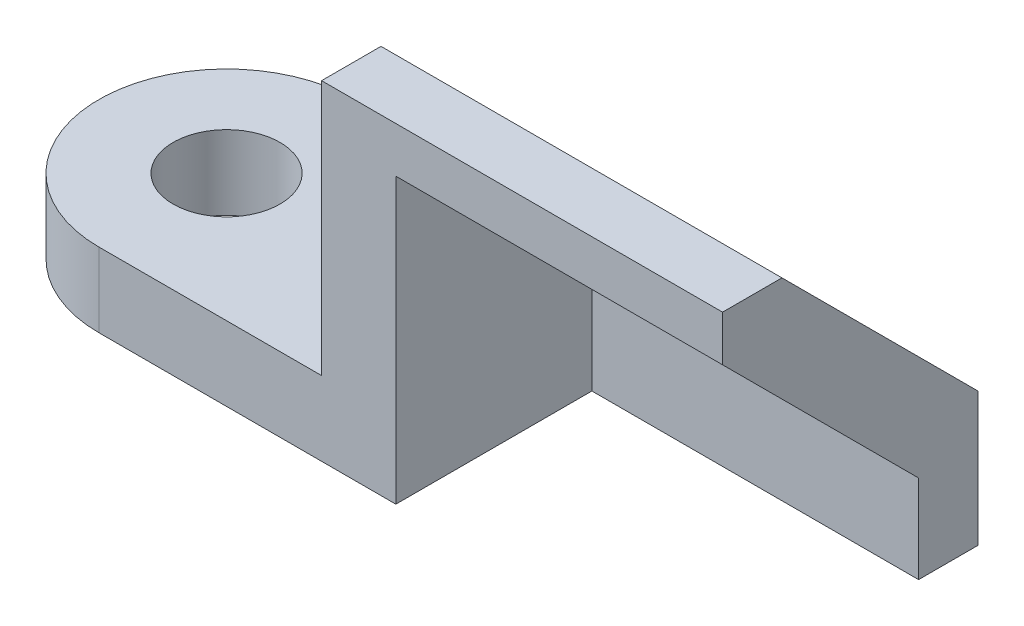
ISO-10303-21;
HEADER;
FILE_DESCRIPTION(('STEP AP214'),'2;1');
FILE_NAME('part.step','',(''),(''),'','','');
FILE_SCHEMA(('AUTOMOTIVE_DESIGN { 1 0 10303 214 1 1 1 1 }'));
ENDSEC;
DATA;
#1=APPLICATION_CONTEXT('core data for automotive mechanical design processes');
#2=APPLICATION_PROTOCOL_DEFINITION('international standard','automotive_design',2000,#1);
#3=PRODUCT_CONTEXT('',#1,'mechanical');
#4=PRODUCT('Part','Part','',(#3));
#5=PRODUCT_RELATED_PRODUCT_CATEGORY('part','',(#4));
#6=PRODUCT_DEFINITION_FORMATION('','',#4);
#7=PRODUCT_DEFINITION_CONTEXT('part definition',#1,'design');
#8=PRODUCT_DEFINITION('design','',#6,#7);
#9=PRODUCT_DEFINITION_SHAPE('','',#8);
#10=(LENGTH_UNIT() NAMED_UNIT(*) SI_UNIT(.MILLI.,.METRE.));
#11=(NAMED_UNIT(*) PLANE_ANGLE_UNIT() SI_UNIT($,.RADIAN.));
#12=(NAMED_UNIT(*) SI_UNIT($,.STERADIAN.) SOLID_ANGLE_UNIT());
#13=UNCERTAINTY_MEASURE_WITH_UNIT(LENGTH_MEASURE(1.E-05),#10,'distance_accuracy_value','');
#14=(GEOMETRIC_REPRESENTATION_CONTEXT(3) GLOBAL_UNCERTAINTY_ASSIGNED_CONTEXT((#13)) GLOBAL_UNIT_ASSIGNED_CONTEXT((#10,
#11,#12)) REPRESENTATION_CONTEXT('',''));
#15=CARTESIAN_POINT('',(0.,0.,0.));
#16=DIRECTION('',(0.,0.,1.));
#17=DIRECTION('',(1.,0.,0.));
#18=AXIS2_PLACEMENT_3D('',#15,#16,#17);
#19=CARTESIAN_POINT('',(12.7,3.175,-5.461));
#20=DIRECTION('',(-1.,0.,0.));
#21=DIRECTION('',(0.,0.,1.));
#22=AXIS2_PLACEMENT_3D('',#19,#20,#21);
#23=PLANE('',#22);
#24=DIRECTION('',(0.,-1.,0.));
#25=VECTOR('',#24,1.);
#26=CARTESIAN_POINT('',(12.7,3.76487193946543,-2.921));
#27=LINE('',#26,#25);
#28=CARTESIAN_POINT('',(12.7,3.76487193946543,-2.921));
#29=VERTEX_POINT('',#28);
#30=CARTESIAN_POINT('',(12.7,0.,-2.921));
#31=VERTEX_POINT('',#30);
#32=EDGE_CURVE('E158',#29,#31,#27,.T.);
#33=ORIENTED_EDGE('',*,*,#32,.F.);
#34=DIRECTION('',(0.,-0.707106781186547,-0.707106781186548));
#35=VECTOR('',#34,1.);
#36=CARTESIAN_POINT('',(12.7,12.1468719394654,5.461));
#37=LINE('',#36,#35);
#38=CARTESIAN_POINT('',(12.7,12.1468719394654,5.461));
#39=VERTEX_POINT('',#38);
#40=EDGE_CURVE('E155',#39,#29,#37,.T.);
#41=ORIENTED_EDGE('',*,*,#40,.F.);
#42=DIRECTION('',(0.,-1.,0.));
#43=VECTOR('',#42,1.);
#44=CARTESIAN_POINT('',(12.7,3.175,5.461));
#45=LINE('',#44,#43);
#46=CARTESIAN_POINT('',(12.7,0.,5.461));
#47=VERTEX_POINT('',#46);
#48=EDGE_CURVE('E129',#39,#47,#45,.T.);
#49=ORIENTED_EDGE('',*,*,#48,.T.);
#50=DIRECTION('',(0.,0.,-1.));
#51=VECTOR('',#50,1.);
#52=CARTESIAN_POINT('',(12.7,0.,-5.461));
#53=LINE('',#52,#51);
#54=EDGE_CURVE('E214',#47,#31,#53,.T.);
#55=ORIENTED_EDGE('',*,*,#54,.T.);
#56=EDGE_LOOP('',(#33,#41,#49,#55));
#57=FACE_BOUND('',#56,.T.);
#58=ADVANCED_FACE('F41',(#57),#23,.F.);
#59=CARTESIAN_POINT('',(0.,3.175,0.));
#60=DIRECTION('',(0.,1.,0.));
#61=DIRECTION('',(0.,0.,1.));
#62=AXIS2_PLACEMENT_3D('',#59,#60,#61);
#63=PLANE('',#62);
#64=DIRECTION('',(0.,0.,1.));
#65=VECTOR('',#64,1.);
#66=CARTESIAN_POINT('',(9.525,3.175,5.461));
#67=LINE('',#66,#65);
#68=CARTESIAN_POINT('',(9.525,3.175,-5.461));
#69=VERTEX_POINT('',#68);
#70=CARTESIAN_POINT('',(9.525,3.175,5.461));
#71=VERTEX_POINT('',#70);
#72=EDGE_CURVE('E171',#69,#71,#67,.T.);
#73=ORIENTED_EDGE('',*,*,#72,.F.);
#74=DIRECTION('',(-1.,0.,0.));
#75=VECTOR('',#74,1.);
#76=CARTESIAN_POINT('',(0.,3.175,-5.461));
#77=LINE('',#76,#75);
#78=CARTESIAN_POINT('',(0.,3.175,-5.461));
#79=VERTEX_POINT('',#78);
#80=EDGE_CURVE('E204',#69,#79,#77,.T.);
#81=ORIENTED_EDGE('',*,*,#80,.T.);
#82=CARTESIAN_POINT('',(0.,3.175,0.));
#83=DIRECTION('',(0.,1.,0.));
#84=DIRECTION('',(0.,0.,1.));
#85=AXIS2_PLACEMENT_3D('',#82,#83,#84);
#86=CIRCLE('',#85,5.461);
#87=CARTESIAN_POINT('',(0.,3.175,5.461));
#88=VERTEX_POINT('',#87);
#89=EDGE_CURVE('E195',#79,#88,#86,.T.);
#90=ORIENTED_EDGE('',*,*,#89,.T.);
#91=DIRECTION('',(1.,0.,0.));
#92=VECTOR('',#91,1.);
#93=CARTESIAN_POINT('',(12.7,3.175,5.461));
#94=LINE('',#93,#92);
#95=EDGE_CURVE('E199',#88,#71,#94,.T.);
#96=ORIENTED_EDGE('',*,*,#95,.T.);
#97=EDGE_LOOP('',(#73,#81,#90,#96));
#98=FACE_BOUND('',#97,.T.);
#99=CARTESIAN_POINT('',(0.,3.175,0.));
#100=DIRECTION('',(0.,1.,0.));
#101=DIRECTION('',(0.,0.,1.));
#102=AXIS2_PLACEMENT_3D('',#99,#100,#101);
#103=CIRCLE('',#102,2.286);
#104=CARTESIAN_POINT('',(0.,3.175,2.286));
#105=VERTEX_POINT('',#104);
#106=EDGE_CURVE('E187',#105,#105,#103,.T.);
#107=ORIENTED_EDGE('',*,*,#106,.F.);
#108=EDGE_LOOP('',(#107));
#109=FACE_BOUND('',#108,.T.);
#110=ADVANCED_FACE('F268',(#98,#109),#63,.T.);
#111=CARTESIAN_POINT('',(0.,0.,0.));
#112=DIRECTION('',(0.,1.,0.));
#113=DIRECTION('',(0.,0.,1.));
#114=AXIS2_PLACEMENT_3D('',#111,#112,#113);
#115=PLANE('',#114);
#116=CARTESIAN_POINT('',(0.,0.,0.));
#117=DIRECTION('',(0.,1.,0.));
#118=DIRECTION('',(0.,0.,1.));
#119=AXIS2_PLACEMENT_3D('',#116,#117,#118);
#120=CIRCLE('',#119,5.461);
#121=CARTESIAN_POINT('',(0.,0.,-5.461));
#122=VERTEX_POINT('',#121);
#123=CARTESIAN_POINT('',(0.,0.,5.461));
#124=VERTEX_POINT('',#123);
#125=EDGE_CURVE('E191',#122,#124,#120,.T.);
#126=ORIENTED_EDGE('',*,*,#125,.F.);
#127=DIRECTION('',(-1.,0.,0.));
#128=VECTOR('',#127,1.);
#129=CARTESIAN_POINT('',(0.,0.,-5.461));
#130=LINE('',#129,#128);
#131=CARTESIAN_POINT('',(26.67,0.,-5.461));
#132=VERTEX_POINT('',#131);
#133=EDGE_CURVE('E200',#132,#122,#130,.T.);
#134=ORIENTED_EDGE('',*,*,#133,.F.);
#135=DIRECTION('',(0.,0.,-1.));
#136=VECTOR('',#135,1.);
#137=CARTESIAN_POINT('',(26.67,0.,-2.921));
#138=LINE('',#137,#136);
#139=CARTESIAN_POINT('',(26.67,0.,-2.921));
#140=VERTEX_POINT('',#139);
#141=EDGE_CURVE('E143',#140,#132,#138,.T.);
#142=ORIENTED_EDGE('',*,*,#141,.F.);
#143=DIRECTION('',(-1.,0.,0.));
#144=VECTOR('',#143,1.);
#145=CARTESIAN_POINT('',(26.67,0.,-2.921));
#146=LINE('',#145,#144);
#147=EDGE_CURVE('E154',#140,#31,#146,.T.);
#148=ORIENTED_EDGE('',*,*,#147,.T.);
#149=ORIENTED_EDGE('',*,*,#54,.F.);
#150=DIRECTION('',(1.,0.,0.));
#151=VECTOR('',#150,1.);
#152=CARTESIAN_POINT('',(12.7,0.,5.461));
#153=LINE('',#152,#151);
#154=EDGE_CURVE('E211',#124,#47,#153,.T.);
#155=ORIENTED_EDGE('',*,*,#154,.F.);
#156=EDGE_LOOP('',(#126,#134,#142,#148,#149,#155));
#157=FACE_BOUND('',#156,.T.);
#158=CARTESIAN_POINT('',(0.,0.,0.));
#159=DIRECTION('',(0.,1.,0.));
#160=DIRECTION('',(0.,0.,1.));
#161=AXIS2_PLACEMENT_3D('',#158,#159,#160);
#162=CIRCLE('',#161,2.286);
#163=CARTESIAN_POINT('',(0.,0.,2.286));
#164=VERTEX_POINT('',#163);
#165=EDGE_CURVE('E186',#164,#164,#162,.T.);
#166=ORIENTED_EDGE('',*,*,#165,.T.);
#167=EDGE_LOOP('',(#166));
#168=FACE_BOUND('',#167,.T.);
#169=ADVANCED_FACE('F274',(#157,#168),#115,.F.);
#170=CARTESIAN_POINT('',(0.,3.175,0.));
#171=DIRECTION('',(0.,-1.,0.));
#172=DIRECTION('',(0.,0.,-1.));
#173=AXIS2_PLACEMENT_3D('',#170,#171,#172);
#174=CYLINDRICAL_SURFACE('',#173,5.461);
#175=ORIENTED_EDGE('',*,*,#125,.T.);
#176=DIRECTION('',(0.,-1.,0.));
#177=VECTOR('',#176,1.);
#178=CARTESIAN_POINT('',(0.,3.175,5.461));
#179=LINE('',#178,#177);
#180=EDGE_CURVE('E224',#88,#124,#179,.T.);
#181=ORIENTED_EDGE('',*,*,#180,.F.);
#182=ORIENTED_EDGE('',*,*,#89,.F.);
#183=DIRECTION('',(0.,-1.,0.));
#184=VECTOR('',#183,1.);
#185=CARTESIAN_POINT('',(0.,3.175,-5.461));
#186=LINE('',#185,#184);
#187=EDGE_CURVE('E207',#79,#122,#186,.T.);
#188=ORIENTED_EDGE('',*,*,#187,.T.);
#189=EDGE_LOOP('',(#175,#181,#182,#188));
#190=FACE_BOUND('',#189,.T.);
#191=ADVANCED_FACE('F282',(#190),#174,.T.);
#192=CARTESIAN_POINT('',(12.7,3.175,5.461));
#193=DIRECTION('',(0.,0.,-1.));
#194=DIRECTION('',(-1.,0.,0.));
#195=AXIS2_PLACEMENT_3D('',#192,#193,#194);
#196=PLANE('',#195);
#197=DIRECTION('',(0.,-1.,0.));
#198=VECTOR('',#197,1.);
#199=CARTESIAN_POINT('',(26.67,16.637,5.461));
#200=LINE('',#199,#198);
#201=CARTESIAN_POINT('',(26.67,14.097,5.461));
#202=VERTEX_POINT('',#201);
#203=CARTESIAN_POINT('',(26.67,12.1468719394654,5.461));
#204=VERTEX_POINT('',#203);
#205=EDGE_CURVE('E115',#202,#204,#200,.T.);
#206=ORIENTED_EDGE('',*,*,#205,.F.);
#207=DIRECTION('',(-1.,0.,0.));
#208=VECTOR('',#207,1.);
#209=CARTESIAN_POINT('',(9.525,14.097,5.461));
#210=LINE('',#209,#208);
#211=CARTESIAN_POINT('',(9.525,14.097,5.461));
#212=VERTEX_POINT('',#211);
#213=EDGE_CURVE('E51',#202,#212,#210,.T.);
#214=ORIENTED_EDGE('',*,*,#213,.T.);
#215=DIRECTION('',(0.,-1.,0.));
#216=VECTOR('',#215,1.);
#217=CARTESIAN_POINT('',(9.525,5.715,5.461));
#218=LINE('',#217,#216);
#219=EDGE_CURVE('E176',#212,#71,#218,.T.);
#220=ORIENTED_EDGE('',*,*,#219,.T.);
#221=ORIENTED_EDGE('',*,*,#95,.F.);
#222=ORIENTED_EDGE('',*,*,#180,.T.);
#223=ORIENTED_EDGE('',*,*,#154,.T.);
#224=ORIENTED_EDGE('',*,*,#48,.F.);
#225=DIRECTION('',(-1.,0.,0.));
#226=VECTOR('',#225,1.);
#227=CARTESIAN_POINT('',(26.67,12.1468719394654,5.461));
#228=LINE('',#227,#226);
#229=EDGE_CURVE('E126',#204,#39,#228,.T.);
#230=ORIENTED_EDGE('',*,*,#229,.F.);
#231=EDGE_LOOP('',(#206,#214,#220,#221,#222,#223,#224,#230));
#232=FACE_BOUND('',#231,.T.);
#233=ADVANCED_FACE('F127',(#232),#196,.F.);
#234=CARTESIAN_POINT('',(0.,3.175,-5.461));
#235=DIRECTION('',(0.,0.,1.));
#236=DIRECTION('',(1.,0.,0.));
#237=AXIS2_PLACEMENT_3D('',#234,#235,#236);
#238=PLANE('',#237);
#239=ORIENTED_EDGE('',*,*,#133,.T.);
#240=ORIENTED_EDGE('',*,*,#187,.F.);
#241=ORIENTED_EDGE('',*,*,#80,.F.);
#242=DIRECTION('',(0.,-1.,0.));
#243=VECTOR('',#242,1.);
#244=CARTESIAN_POINT('',(9.525,5.715,-5.461));
#245=LINE('',#244,#243);
#246=CARTESIAN_POINT('',(9.525,5.715,-5.461));
#247=VERTEX_POINT('',#246);
#248=EDGE_CURVE('E182',#247,#69,#245,.T.);
#249=ORIENTED_EDGE('',*,*,#248,.F.);
#250=DIRECTION('',(-1.,0.,0.));
#251=VECTOR('',#250,1.);
#252=CARTESIAN_POINT('',(12.7,5.715,-5.461));
#253=LINE('',#252,#251);
#254=CARTESIAN_POINT('',(26.67,5.715,-5.461));
#255=VERTEX_POINT('',#254);
#256=EDGE_CURVE('E172',#255,#247,#253,.T.);
#257=ORIENTED_EDGE('',*,*,#256,.F.);
#258=DIRECTION('',(0.,1.,0.));
#259=VECTOR('',#258,1.);
#260=CARTESIAN_POINT('',(26.67,0.,-5.461));
#261=LINE('',#260,#259);
#262=EDGE_CURVE('E150',#132,#255,#261,.T.);
#263=ORIENTED_EDGE('',*,*,#262,.F.);
#264=EDGE_LOOP('',(#239,#240,#241,#249,#257,#263));
#265=FACE_BOUND('',#264,.T.);
#266=ADVANCED_FACE('F279',(#265),#238,.F.);
#267=CARTESIAN_POINT('',(0.,3.175,0.));
#268=DIRECTION('',(0.,-1.,0.));
#269=DIRECTION('',(0.,0.,-1.));
#270=AXIS2_PLACEMENT_3D('',#267,#268,#269);
#271=CYLINDRICAL_SURFACE('',#270,2.286);
#272=ORIENTED_EDGE('',*,*,#106,.T.);
#273=EDGE_LOOP('',(#272));
#274=FACE_BOUND('',#273,.T.);
#275=ORIENTED_EDGE('',*,*,#165,.F.);
#276=EDGE_LOOP('',(#275));
#277=FACE_BOUND('',#276,.T.);
#278=ADVANCED_FACE('F264',(#274,#277),#271,.F.);
#279=CARTESIAN_POINT('',(9.525,5.715,5.461));
#280=DIRECTION('',(1.,0.,0.));
#281=DIRECTION('',(0.,0.,-1.));
#282=AXIS2_PLACEMENT_3D('',#279,#280,#281);
#283=PLANE('',#282);
#284=ORIENTED_EDGE('',*,*,#219,.F.);
#285=DIRECTION('',(0.,0.,-1.));
#286=VECTOR('',#285,1.);
#287=CARTESIAN_POINT('',(9.525,14.097,2.92100000000001));
#288=LINE('',#287,#286);
#289=CARTESIAN_POINT('',(9.525,14.097,2.92100000000001));
#290=VERTEX_POINT('',#289);
#291=EDGE_CURVE('E11',#212,#290,#288,.T.);
#292=ORIENTED_EDGE('',*,*,#291,.T.);
#293=DIRECTION('',(0.,0.707106781186549,0.707106781186546));
#294=VECTOR('',#293,1.);
#295=CARTESIAN_POINT('',(9.525,20.7713914297827,9.59539142978262));
#296=LINE('',#295,#294);
#297=EDGE_CURVE('E133',#247,#290,#296,.T.);
#298=ORIENTED_EDGE('',*,*,#297,.F.);
#299=ORIENTED_EDGE('',*,*,#248,.T.);
#300=ORIENTED_EDGE('',*,*,#72,.T.);
#301=EDGE_LOOP('',(#284,#292,#298,#299,#300));
#302=FACE_BOUND('',#301,.T.);
#303=ADVANCED_FACE('F255',(#302),#283,.F.);
#304=CARTESIAN_POINT('',(0.,5.58799999999999,-5.58800000000001));
#305=DIRECTION('',(0.,0.707106781186546,-0.707106781186549));
#306=DIRECTION('',(0.,0.707106781186549,0.707106781186546));
#307=AXIS2_PLACEMENT_3D('',#304,#305,#306);
#308=PLANE('',#307);
#309=CARTESIAN_POINT('',(20.32,10.2051280605346,-0.970871939465432));
#310=DIRECTION('',(0.,0.707106781186546,-0.707106781186549));
#311=DIRECTION('',(0.,0.707106781186549,0.707106781186546));
#312=AXIS2_PLACEMENT_3D('',#309,#310,#311);
#313=CIRCLE('',#312,3.1115);
#314=CARTESIAN_POINT('',(20.32,12.4052908101965,1.22929081019651));
#315=VERTEX_POINT('',#314);
#316=EDGE_CURVE('E247',#315,#315,#313,.T.);
#317=ORIENTED_EDGE('',*,*,#316,.F.);
#318=EDGE_LOOP('',(#317));
#319=FACE_BOUND('',#318,.T.);
#320=ORIENTED_EDGE('',*,*,#297,.T.);
#321=DIRECTION('',(1.,0.,0.));
#322=VECTOR('',#321,1.);
#323=CARTESIAN_POINT('',(26.67,14.097,2.92100000000002));
#324=LINE('',#323,#322);
#325=CARTESIAN_POINT('',(26.67,14.097,2.92100000000001));
#326=VERTEX_POINT('',#325);
#327=EDGE_CURVE('E228',#290,#326,#324,.T.);
#328=ORIENTED_EDGE('',*,*,#327,.T.);
#329=DIRECTION('',(0.,0.707106781186549,0.707106781186546));
#330=VECTOR('',#329,1.);
#331=CARTESIAN_POINT('',(26.67,5.715,-5.461));
#332=LINE('',#331,#330);
#333=EDGE_CURVE('E122',#255,#326,#332,.T.);
#334=ORIENTED_EDGE('',*,*,#333,.F.);
#335=ORIENTED_EDGE('',*,*,#256,.T.);
#336=EDGE_LOOP('',(#320,#328,#334,#335));
#337=FACE_BOUND('',#336,.T.);
#338=ADVANCED_FACE('F237',(#319,#337),#308,.T.);
#339=CARTESIAN_POINT('',(26.67,12.1468719394654,5.461));
#340=DIRECTION('',(0.,0.707106781186548,-0.707106781186547));
#341=DIRECTION('',(0.,0.707106781186547,0.707106781186548));
#342=AXIS2_PLACEMENT_3D('',#339,#340,#341);
#343=PLANE('',#342);
#344=CARTESIAN_POINT('',(20.32,7.9600640302673,1.27419209080187));
#345=DIRECTION('',(0.,0.707106781186548,-0.707106781186547));
#346=DIRECTION('',(0.,0.707106781186547,0.707106781186548));
#347=AXIS2_PLACEMENT_3D('',#344,#345,#346);
#348=CIRCLE('',#347,3.1115);
#349=CARTESIAN_POINT('',(20.32,10.1602267799292,3.47435484046381));
#350=VERTEX_POINT('',#349);
#351=EDGE_CURVE('E159',#350,#350,#348,.F.);
#352=ORIENTED_EDGE('',*,*,#351,.F.);
#353=EDGE_LOOP('',(#352));
#354=FACE_BOUND('',#353,.T.);
#355=ORIENTED_EDGE('',*,*,#40,.T.);
#356=DIRECTION('',(-1.,0.,0.));
#357=VECTOR('',#356,1.);
#358=CARTESIAN_POINT('',(26.67,3.76487193946543,-2.921));
#359=LINE('',#358,#357);
#360=CARTESIAN_POINT('',(26.67,3.76487193946543,-2.921));
#361=VERTEX_POINT('',#360);
#362=EDGE_CURVE('E134',#361,#29,#359,.T.);
#363=ORIENTED_EDGE('',*,*,#362,.F.);
#364=DIRECTION('',(0.,-0.707106781186547,-0.707106781186548));
#365=VECTOR('',#364,1.);
#366=CARTESIAN_POINT('',(26.67,12.1468719394654,5.461));
#367=LINE('',#366,#365);
#368=EDGE_CURVE('E119',#204,#361,#367,.T.);
#369=ORIENTED_EDGE('',*,*,#368,.F.);
#370=ORIENTED_EDGE('',*,*,#229,.T.);
#371=EDGE_LOOP('',(#355,#363,#369,#370));
#372=FACE_BOUND('',#371,.T.);
#373=ADVANCED_FACE('F136',(#354,#372),#343,.F.);
#374=CARTESIAN_POINT('',(26.67,3.76487193946543,-2.921));
#375=DIRECTION('',(0.,0.,-1.));
#376=DIRECTION('',(0.,1.,0.));
#377=AXIS2_PLACEMENT_3D('',#374,#375,#376);
#378=PLANE('',#377);
#379=ORIENTED_EDGE('',*,*,#32,.T.);
#380=ORIENTED_EDGE('',*,*,#147,.F.);
#381=DIRECTION('',(0.,-1.,0.));
#382=VECTOR('',#381,1.);
#383=CARTESIAN_POINT('',(26.67,3.76487193946543,-2.921));
#384=LINE('',#383,#382);
#385=EDGE_CURVE('E140',#361,#140,#384,.T.);
#386=ORIENTED_EDGE('',*,*,#385,.F.);
#387=ORIENTED_EDGE('',*,*,#362,.T.);
#388=EDGE_LOOP('',(#379,#380,#386,#387));
#389=FACE_BOUND('',#388,.T.);
#390=ADVANCED_FACE('F261',(#389),#378,.F.);
#391=CARTESIAN_POINT('',(26.67,0.,0.));
#392=DIRECTION('',(1.,0.,0.));
#393=DIRECTION('',(0.,0.,-1.));
#394=AXIS2_PLACEMENT_3D('',#391,#392,#393);
#395=PLANE('',#394);
#396=ORIENTED_EDGE('',*,*,#333,.T.);
#397=DIRECTION('',(0.,0.,1.));
#398=VECTOR('',#397,1.);
#399=CARTESIAN_POINT('',(26.67,14.097,0.));
#400=LINE('',#399,#398);
#401=EDGE_CURVE('E65',#326,#202,#400,.T.);
#402=ORIENTED_EDGE('',*,*,#401,.T.);
#403=ORIENTED_EDGE('',*,*,#205,.T.);
#404=ORIENTED_EDGE('',*,*,#368,.T.);
#405=ORIENTED_EDGE('',*,*,#385,.T.);
#406=ORIENTED_EDGE('',*,*,#141,.T.);
#407=ORIENTED_EDGE('',*,*,#262,.T.);
#408=EDGE_LOOP('',(#396,#402,#403,#404,#405,#406,#407));
#409=FACE_BOUND('',#408,.T.);
#410=ADVANCED_FACE('F117',(#409),#395,.T.);
#411=CARTESIAN_POINT('',(20.32,1.7370640302673,7.49719209080188));
#412=DIRECTION('',(0.,0.707106781186546,-0.707106781186549));
#413=DIRECTION('',(0.,0.707106781186549,0.707106781186546));
#414=AXIS2_PLACEMENT_3D('',#411,#412,#413);
#415=CYLINDRICAL_SURFACE('',#414,3.1115);
#416=ORIENTED_EDGE('',*,*,#351,.T.);
#417=EDGE_LOOP('',(#416));
#418=FACE_BOUND('',#417,.T.);
#419=ORIENTED_EDGE('',*,*,#316,.T.);
#420=EDGE_LOOP('',(#419));
#421=FACE_BOUND('',#420,.T.);
#422=ADVANCED_FACE('F252',(#418,#421),#415,.F.);
#423=CARTESIAN_POINT('',(0.,14.097,2.92100000000001));
#424=DIRECTION('',(0.,1.,0.));
#425=DIRECTION('',(-1.,0.,0.));
#426=AXIS2_PLACEMENT_3D('',#423,#424,#425);
#427=PLANE('',#426);
#428=ORIENTED_EDGE('',*,*,#291,.F.);
#429=ORIENTED_EDGE('',*,*,#213,.F.);
#430=ORIENTED_EDGE('',*,*,#401,.F.);
#431=ORIENTED_EDGE('',*,*,#327,.F.);
#432=EDGE_LOOP('',(#428,#429,#430,#431));
#433=FACE_BOUND('',#432,.T.);
#434=ADVANCED_FACE('F44',(#433),#427,.T.);
#435=CLOSED_SHELL('',(#58,#110,#169,#191,#233,#266,#278,#303,#338,#373,#390,#410,#422,#434));
#436=MANIFOLD_SOLID_BREP('B2',#435);
#437=ADVANCED_BREP_SHAPE_REPRESENTATION('',(#18,#436),#14);
#438=SHAPE_DEFINITION_REPRESENTATION(#9,#437);
ENDSEC;
END-ISO-10303-21;
